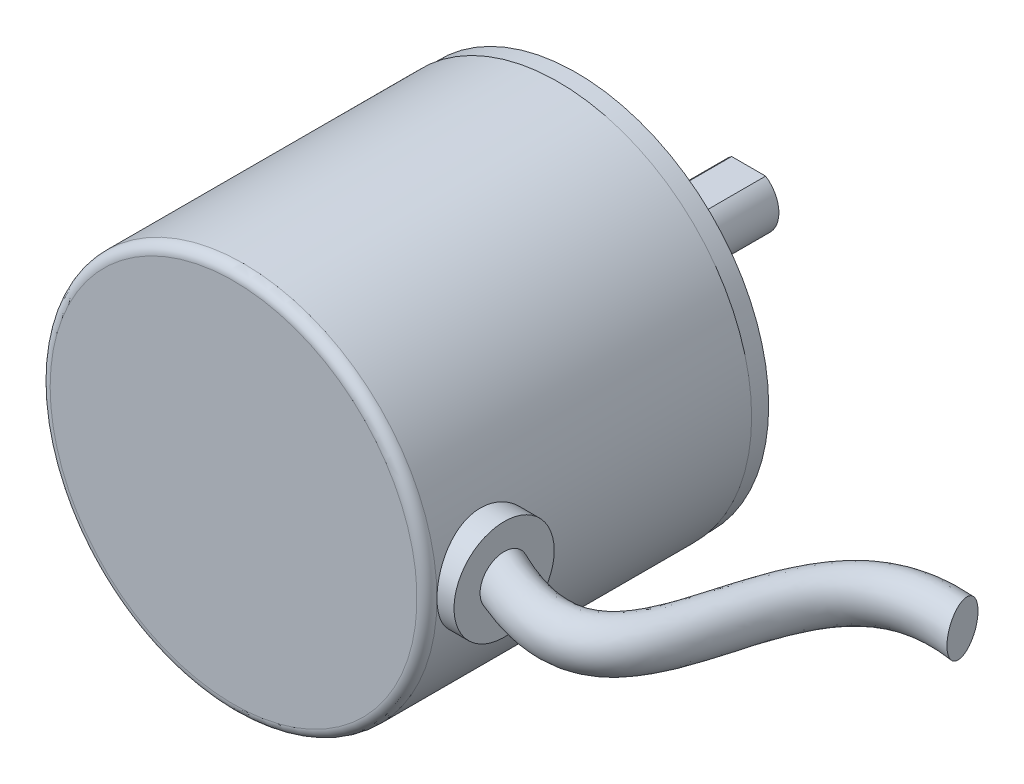
ISO-10303-21;
HEADER;
FILE_DESCRIPTION(('STEP AP214'),'2;1');
FILE_NAME('part.step','',(''),(''),'','','');
FILE_SCHEMA(('AUTOMOTIVE_DESIGN { 1 0 10303 214 1 1 1 1 }'));
ENDSEC;
DATA;
#1=APPLICATION_CONTEXT('core data for automotive mechanical design processes');
#2=APPLICATION_PROTOCOL_DEFINITION('international standard','automotive_design',2000,#1);
#3=PRODUCT_CONTEXT('',#1,'mechanical');
#4=PRODUCT('Part','Part','',(#3));
#5=PRODUCT_RELATED_PRODUCT_CATEGORY('part','',(#4));
#6=PRODUCT_DEFINITION_FORMATION('','',#4);
#7=PRODUCT_DEFINITION_CONTEXT('part definition',#1,'design');
#8=PRODUCT_DEFINITION('design','',#6,#7);
#9=PRODUCT_DEFINITION_SHAPE('','',#8);
#10=(LENGTH_UNIT() NAMED_UNIT(*) SI_UNIT(.MILLI.,.METRE.));
#11=(NAMED_UNIT(*) PLANE_ANGLE_UNIT() SI_UNIT($,.RADIAN.));
#12=(NAMED_UNIT(*) SI_UNIT($,.STERADIAN.) SOLID_ANGLE_UNIT());
#13=UNCERTAINTY_MEASURE_WITH_UNIT(LENGTH_MEASURE(1.E-05),#10,'distance_accuracy_value','');
#14=(GEOMETRIC_REPRESENTATION_CONTEXT(3) GLOBAL_UNCERTAINTY_ASSIGNED_CONTEXT((#13)) GLOBAL_UNIT_ASSIGNED_CONTEXT((#10,
#11,#12)) REPRESENTATION_CONTEXT('',''));
#15=CARTESIAN_POINT('',(0.,0.,0.));
#16=DIRECTION('',(0.,0.,1.));
#17=DIRECTION('',(1.,0.,0.));
#18=AXIS2_PLACEMENT_3D('',#15,#16,#17);
#19=CARTESIAN_POINT('',(0.,0.,0.));
#20=DIRECTION('',(0.,0.,1.));
#21=DIRECTION('',(1.,0.,0.));
#22=AXIS2_PLACEMENT_3D('',#19,#20,#21);
#23=CYLINDRICAL_SURFACE('',#22,19.3);
#24=CARTESIAN_POINT('',(0.,0.,-32.4));
#25=DIRECTION('',(0.,0.,1.));
#26=DIRECTION('',(1.,0.,0.));
#27=AXIS2_PLACEMENT_3D('',#24,#25,#26);
#28=CIRCLE('',#27,19.3);
#29=CARTESIAN_POINT('',(19.3,0.,-32.4));
#30=VERTEX_POINT('',#29);
#31=EDGE_CURVE('E119',#30,#30,#28,.T.);
#32=ORIENTED_EDGE('',*,*,#31,.T.);
#33=EDGE_LOOP('',(#32));
#34=FACE_BOUND('',#33,.T.);
#35=CARTESIAN_POINT('',(19.3,0.,-11.));
#36=CARTESIAN_POINT('',(19.2999955823132,0.275922296854778,-10.9999928770508));
#37=CARTESIAN_POINT('',(19.2940243522415,0.551922372861501,-10.9770833661282));
#38=CARTESIAN_POINT('',(19.2707832217401,1.09599052706957,-10.886201236279));
#39=CARTESIAN_POINT('',(19.2535074372038,1.36405439842268,-10.8182051492006));
#40=CARTESIAN_POINT('',(19.2095668815945,1.88431656958455,-10.6394946857354));
#41=CARTESIAN_POINT('',(19.1829138368732,2.1365342230973,-10.5288336457832));
#42=CARTESIAN_POINT('',(19.1230455895967,2.61882826887126,-10.2681276234945));
#43=CARTESIAN_POINT('',(19.0898300486462,2.84890351844845,-10.1180806100878));
#44=CARTESIAN_POINT('',(19.0196154495822,3.28544118051561,-9.77937747318028));
#45=CARTESIAN_POINT('',(18.9825546076903,3.49134729127922,-9.5900171431324));
#46=CARTESIAN_POINT('',(18.9092294286999,3.86886347852799,-9.17956906483793));
#47=CARTESIAN_POINT('',(18.8729651886307,4.04046939750563,-8.95847747603593));
#48=CARTESIAN_POINT('',(18.8047114585131,4.34718172860453,-8.48645852332762));
#49=CARTESIAN_POINT('',(18.7728001472016,4.48165636257465,-8.23510829957842));
#50=CARTESIAN_POINT('',(18.7177704081012,4.70622258399684,-7.71240743511189));
#51=CARTESIAN_POINT('',(18.6946504598122,4.79632184713577,-7.44106026264381));
#52=CARTESIAN_POINT('',(18.6604577314213,4.92766356036293,-6.89220895257353));
#53=CARTESIAN_POINT('',(18.6491376084621,4.96991077872982,-6.6149610354263));
#54=CARTESIAN_POINT('',(18.6390866109142,5.00748039103332,-6.05709956854782));
#55=CARTESIAN_POINT('',(18.640353526134,5.00281102317686,-5.77648661833454));
#56=CARTESIAN_POINT('',(18.6551116320814,4.94747953237369,-5.22763695769754));
#57=CARTESIAN_POINT('',(18.668281957902,4.89802456858564,-4.95926856071223));
#58=CARTESIAN_POINT('',(18.7048502811364,4.75645556426157,-4.43477415516337));
#59=CARTESIAN_POINT('',(18.7282490549199,4.66433828549686,-4.17864907754173));
#60=CARTESIAN_POINT('',(18.782925670159,4.4390550781482,-3.68272337186734));
#61=CARTESIAN_POINT('',(18.8142854052177,4.30545906400802,-3.44312752722263));
#62=CARTESIAN_POINT('',(18.8813054514343,4.00131106442746,-2.98932633069684));
#63=CARTESIAN_POINT('',(18.9169665653326,3.83075217608312,-2.77512573301329));
#64=CARTESIAN_POINT('',(18.9899140179257,3.45131027480728,-2.37128865501125));
#65=CARTESIAN_POINT('',(19.0272166358165,3.24141121656524,-2.18260850646035));
#66=CARTESIAN_POINT('',(19.0982594663905,2.7924989573545,-1.84293677781641));
#67=CARTESIAN_POINT('',(19.1319995538198,2.55348473336963,-1.69194652259743));
#68=CARTESIAN_POINT('',(19.1923044100216,2.05169995380134,-1.43155219368105));
#69=CARTESIAN_POINT('',(19.2188406202885,1.78884020273117,-1.32231295665176));
#70=CARTESIAN_POINT('',(19.261540870389,1.2476446713342,-1.14984575448703));
#71=CARTESIAN_POINT('',(19.2777070453288,0.969312089570021,-1.08660831759461));
#72=CARTESIAN_POINT('',(19.2975260496811,0.413240156975407,-1.00942230946256));
#73=CARTESIAN_POINT('',(19.3015091358126,0.135692917961652,-0.994172559703715));
#74=CARTESIAN_POINT('',(19.2974585703999,-0.417990665941433,-1.00981283524772));
#75=CARTESIAN_POINT('',(19.2894260861606,-0.694127145270174,-1.04069837853592));
#76=CARTESIAN_POINT('',(19.2624594750327,-1.23256340285446,-1.14666270598067));
#77=CARTESIAN_POINT('',(19.2437026678951,-1.49501425095196,-1.22102310195635));
#78=CARTESIAN_POINT('',(19.1974084064744,-2.00369685340097,-1.41099842811989));
#79=CARTESIAN_POINT('',(19.1698700292998,-2.24992689975833,-1.52661769452475));
#80=CARTESIAN_POINT('',(19.1082854087713,-2.72429044183067,-1.79829222998792));
#81=CARTESIAN_POINT('',(19.074126819279,-2.95199803647117,-1.95506506037911));
#82=CARTESIAN_POINT('',(19.0032537620583,-3.37833276890095,-2.30368750108891));
#83=CARTESIAN_POINT('',(18.9665388197629,-3.57695448577043,-2.49554363516018));
#84=CARTESIAN_POINT('',(18.8934880094063,-3.94490673451397,-2.91494530171224));
#85=CARTESIAN_POINT('',(18.8571879703588,-4.11332155969483,-3.14330187753011));
#86=CARTESIAN_POINT('',(18.7901539794982,-4.40945053300601,-3.62579419893768));
#87=CARTESIAN_POINT('',(18.7594197868037,-4.53716644270592,-3.87992882814904));
#88=CARTESIAN_POINT('',(18.7073449197866,-4.74731210499394,-4.40544316911878));
#89=CARTESIAN_POINT('',(18.6859491627699,-4.83000814294148,-4.67671064817692));
#90=CARTESIAN_POINT('',(18.6549412202573,-4.94843270252857,-5.22994402647412));
#91=CARTESIAN_POINT('',(18.6453262275589,-4.98417241339492,-5.51190736051442));
#92=CARTESIAN_POINT('',(18.6391935297198,-5.0070531294027,-6.06918033564821));
#93=CARTESIAN_POINT('',(18.6422802179428,-4.99566201023499,-6.34442628469769));
#94=CARTESIAN_POINT('',(18.6602822200317,-4.92798830414783,-6.88892866742926));
#95=CARTESIAN_POINT('',(18.6751972612514,-4.87170675196201,-7.15818523902068));
#96=CARTESIAN_POINT('',(18.7149467892529,-4.71667836613896,-7.68133479669966));
#97=CARTESIAN_POINT('',(18.7397124002066,-4.61822603332118,-7.93532065168203));
#98=CARTESIAN_POINT('',(18.7963778546488,-4.38188110097908,-8.4233570812115));
#99=CARTESIAN_POINT('',(18.8282787583192,-4.2439826395876,-8.65740468613371));
#100=CARTESIAN_POINT('',(18.8967317939109,-3.92814037420903,-9.10596778502445));
#101=CARTESIAN_POINT('',(18.9333888280616,-3.74918704166771,-9.31975654595521));
#102=CARTESIAN_POINT('',(19.0066196342379,-3.35825679179517,-9.71474714380576));
#103=CARTESIAN_POINT('',(19.0431933841368,-3.14627194855382,-9.89594113707157));
#104=CARTESIAN_POINT('',(19.1130039268547,-2.69021883218415,-10.2241207836628));
#105=CARTESIAN_POINT('',(19.1461600893385,-2.44559732438478,-10.3703561724299));
#106=CARTESIAN_POINT('',(19.2045327502046,-1.93439800228067,-10.6193958302361));
#107=CARTESIAN_POINT('',(19.2297546183081,-1.66783519208002,-10.7222294885933));
#108=CARTESIAN_POINT('',(19.2659375371114,-1.16834788877053,-10.867270957863));
#109=CARTESIAN_POINT('',(19.2786203773884,-0.937684470660252,-10.9169325114061));
#110=CARTESIAN_POINT('',(19.295653132073,-0.471365997029135,-10.9832986364701));
#111=CARTESIAN_POINT('',(19.3000037738851,-0.23571137905834,-11.0000060849022));
#112=CARTESIAN_POINT('',(19.3,0.,-11.));
#113=B_SPLINE_CURVE_WITH_KNOTS('',3,(#35,#36,#37,#38,#39,#40,#41,#42,#43,#44,#45,#46,#47,#48,
#49,#50,#51,#52,#53,#54,#55,#56,#57,#58,#59,#60,#61,#62,#63,#64,#65,#66,#67,#68,#69,#70,#71,#72,
#73,#74,#75,#76,#77,#78,#79,#80,#81,#82,#83,#84,#85,#86,#87,#88,#89,#90,#91,#92,#93,#94,#95,#96,
#97,#98,#99,#100,#101,#102,#103,#104,#105,#106,#107,#108,#109,#110,#111,#112),.UNSPECIFIED.,.T.,
.F.,(4,2,2,2,2,2,2,2,2,2,2,2,2,2,2,2,2,2,2,2,2,2,2,2,2,2,2,2,2,2,2,2,2,2,2,2,2,2,4),(0.,
0.826902765048128,1.65423628201614,2.48053886655304,3.3068840705377,4.14955475892465,
4.99232752510895,5.84866199633602,6.70484829379974,7.54270279895649,8.38041018560577,
9.19618877567788,10.0120292965359,10.8366287824067,11.6613823970852,12.5114631951909,
13.361573871106,14.2150070156434,15.0682643887744,15.8981771470126,16.728009284993,
17.5445018560062,18.3610802638869,19.1929702787829,20.0250151415136,20.8791093642488,
21.7331666142338,22.582115795559,23.4308626440062,24.2533777202322,25.0758738378656,
25.892717352371,26.7096823165105,27.5494306294879,28.3893807512248,29.2460005251929,
30.1020393080347,30.808496927949,31.5148928710041),.UNSPECIFIED.);
#114=CARTESIAN_POINT('',(19.3,0.,-1.));
#115=VERTEX_POINT('',#114);
#116=EDGE_CURVE('E126',#115,#115,#113,.T.);
#117=ORIENTED_EDGE('',*,*,#116,.F.);
#118=CARTESIAN_POINT('',(0.,0.,-1.));
#119=DIRECTION('',(0.,0.,-1.));
#120=DIRECTION('',(-1.,0.,0.));
#121=AXIS2_PLACEMENT_3D('',#118,#119,#120);
#122=CIRCLE('',#121,19.3);
#123=EDGE_CURVE('E11',#115,#115,#122,.T.);
#124=ORIENTED_EDGE('',*,*,#123,.T.);
#125=EDGE_LOOP('',(#117,#124));
#126=FACE_BOUND('',#125,.T.);
#127=ADVANCED_FACE('F43',(#34,#126),#23,.T.);
#128=CARTESIAN_POINT('',(0.,0.,0.));
#129=DIRECTION('',(0.,0.,1.));
#130=DIRECTION('',(1.,0.,0.));
#131=AXIS2_PLACEMENT_3D('',#128,#129,#130);
#132=CYLINDRICAL_SURFACE('',#131,3.02);
#133=CARTESIAN_POINT('',(0.,0.,-37.9));
#134=DIRECTION('',(0.,0.,1.));
#135=DIRECTION('',(1.,0.,0.));
#136=AXIS2_PLACEMENT_3D('',#133,#134,#135);
#137=CIRCLE('',#136,3.02);
#138=CARTESIAN_POINT('',(3.02,0.,-37.9));
#139=VERTEX_POINT('',#138);
#140=EDGE_CURVE('E98',#139,#139,#137,.T.);
#141=ORIENTED_EDGE('',*,*,#140,.F.);
#142=EDGE_LOOP('',(#141));
#143=FACE_BOUND('',#142,.T.);
#144=DIRECTION('',(0.,0.,1.));
#145=VECTOR('',#144,1.);
#146=CARTESIAN_POINT('',(-1.69422548676379,2.5,0.));
#147=LINE('',#146,#145);
#148=CARTESIAN_POINT('',(-1.69422548676379,2.5,-51.4));
#149=VERTEX_POINT('',#148);
#150=CARTESIAN_POINT('',(-1.69422548676379,2.5,-41.4));
#151=VERTEX_POINT('',#150);
#152=EDGE_CURVE('E93',#149,#151,#147,.T.);
#153=ORIENTED_EDGE('',*,*,#152,.F.);
#154=CARTESIAN_POINT('',(0.,0.,-51.4));
#155=DIRECTION('',(0.,0.,1.));
#156=DIRECTION('',(1.,0.,0.));
#157=AXIS2_PLACEMENT_3D('',#154,#155,#156);
#158=CIRCLE('',#157,3.02);
#159=CARTESIAN_POINT('',(1.69422548676379,2.5,-51.4));
#160=VERTEX_POINT('',#159);
#161=EDGE_CURVE('E95',#149,#160,#158,.T.);
#162=ORIENTED_EDGE('',*,*,#161,.T.);
#163=DIRECTION('',(0.,0.,1.));
#164=VECTOR('',#163,1.);
#165=CARTESIAN_POINT('',(1.69422548676379,2.5,0.));
#166=LINE('',#165,#164);
#167=CARTESIAN_POINT('',(1.69422548676379,2.5,-41.4));
#168=VERTEX_POINT('',#167);
#169=EDGE_CURVE('E61',#168,#160,#166,.F.);
#170=ORIENTED_EDGE('',*,*,#169,.F.);
#171=CARTESIAN_POINT('',(0.,0.,-41.4));
#172=DIRECTION('',(0.,0.,-1.));
#173=DIRECTION('',(-1.,0.,0.));
#174=AXIS2_PLACEMENT_3D('',#171,#172,#173);
#175=CIRCLE('',#174,3.02);
#176=EDGE_CURVE('E124',#151,#168,#175,.T.);
#177=ORIENTED_EDGE('',*,*,#176,.F.);
#178=EDGE_LOOP('',(#153,#162,#170,#177));
#179=FACE_BOUND('',#178,.T.);
#180=ADVANCED_FACE('F155',(#143,#179),#132,.T.);
#181=CARTESIAN_POINT('',(0.,3.02,-51.4));
#182=DIRECTION('',(0.,0.,1.));
#183=DIRECTION('',(1.,0.,0.));
#184=AXIS2_PLACEMENT_3D('',#181,#182,#183);
#185=PLANE('',#184);
#186=DIRECTION('',(-1.,0.,0.));
#187=VECTOR('',#186,1.);
#188=CARTESIAN_POINT('',(0.,2.5,-51.4));
#189=LINE('',#188,#187);
#190=EDGE_CURVE('E122',#160,#149,#189,.T.);
#191=ORIENTED_EDGE('',*,*,#190,.F.);
#192=ORIENTED_EDGE('',*,*,#161,.F.);
#193=EDGE_LOOP('',(#191,#192));
#194=FACE_BOUND('',#193,.T.);
#195=ADVANCED_FACE('F151',(#194),#185,.F.);
#196=CARTESIAN_POINT('',(0.,0.,0.));
#197=DIRECTION('',(0.,0.,-1.));
#198=DIRECTION('',(-1.,0.,0.));
#199=AXIS2_PLACEMENT_3D('',#196,#197,#198);
#200=PLANE('',#199);
#201=CARTESIAN_POINT('',(0.,0.,0.));
#202=DIRECTION('',(0.,0.,-1.));
#203=DIRECTION('',(-1.,0.,0.));
#204=AXIS2_PLACEMENT_3D('',#201,#202,#203);
#205=CIRCLE('',#204,18.3);
#206=CARTESIAN_POINT('',(-18.3,0.,0.));
#207=VERTEX_POINT('',#206);
#208=EDGE_CURVE('E51',#207,#207,#205,.F.);
#209=ORIENTED_EDGE('',*,*,#208,.T.);
#210=EDGE_LOOP('',(#209));
#211=FACE_BOUND('',#210,.T.);
#212=ADVANCED_FACE('F154',(#211),#200,.F.);
#213=CARTESIAN_POINT('',(0.,19.3,-32.4));
#214=DIRECTION('',(0.,0.,1.));
#215=DIRECTION('',(1.,0.,0.));
#216=AXIS2_PLACEMENT_3D('',#213,#214,#215);
#217=PLANE('',#216);
#218=ORIENTED_EDGE('',*,*,#31,.F.);
#219=EDGE_LOOP('',(#218));
#220=FACE_BOUND('',#219,.T.);
#221=CARTESIAN_POINT('',(0.,0.,-32.4));
#222=DIRECTION('',(0.,0.,1.));
#223=DIRECTION('',(1.,0.,0.));
#224=AXIS2_PLACEMENT_3D('',#221,#222,#223);
#225=CIRCLE('',#224,19.2);
#226=CARTESIAN_POINT('',(19.2,0.,-32.4));
#227=VERTEX_POINT('',#226);
#228=EDGE_CURVE('E116',#227,#227,#225,.T.);
#229=ORIENTED_EDGE('',*,*,#228,.T.);
#230=EDGE_LOOP('',(#229));
#231=FACE_BOUND('',#230,.T.);
#232=ADVANCED_FACE('F181',(#220,#231),#217,.F.);
#233=CARTESIAN_POINT('',(0.,0.,0.));
#234=DIRECTION('',(0.,0.,1.));
#235=DIRECTION('',(1.,0.,0.));
#236=AXIS2_PLACEMENT_3D('',#233,#234,#235);
#237=CYLINDRICAL_SURFACE('',#236,19.2);
#238=ORIENTED_EDGE('',*,*,#228,.F.);
#239=EDGE_LOOP('',(#238));
#240=FACE_BOUND('',#239,.T.);
#241=CARTESIAN_POINT('',(0.,0.,-34.2));
#242=DIRECTION('',(0.,0.,1.));
#243=DIRECTION('',(1.,0.,0.));
#244=AXIS2_PLACEMENT_3D('',#241,#242,#243);
#245=CIRCLE('',#244,19.2);
#246=CARTESIAN_POINT('',(19.2,0.,-34.2));
#247=VERTEX_POINT('',#246);
#248=EDGE_CURVE('E113',#247,#247,#245,.T.);
#249=ORIENTED_EDGE('',*,*,#248,.T.);
#250=EDGE_LOOP('',(#249));
#251=FACE_BOUND('',#250,.T.);
#252=ADVANCED_FACE('F178',(#240,#251),#237,.T.);
#253=CARTESIAN_POINT('',(0.,19.2,-34.2));
#254=DIRECTION('',(0.,0.,1.));
#255=DIRECTION('',(1.,0.,0.));
#256=AXIS2_PLACEMENT_3D('',#253,#254,#255);
#257=PLANE('',#256);
#258=CARTESIAN_POINT('',(0.,14.1,-34.2));
#259=DIRECTION('',(0.,0.,-1.));
#260=DIRECTION('',(-1.,0.,0.));
#261=AXIS2_PLACEMENT_3D('',#258,#259,#260);
#262=CIRCLE('',#261,1.25);
#263=CARTESIAN_POINT('',(-1.25,14.1,-34.2));
#264=VERTEX_POINT('',#263);
#265=EDGE_CURVE('E85',#264,#264,#262,.T.);
#266=ORIENTED_EDGE('',*,*,#265,.F.);
#267=EDGE_LOOP('',(#266));
#268=FACE_BOUND('',#267,.T.);
#269=CARTESIAN_POINT('',(-12.2109581933606,-7.05,-34.2));
#270=DIRECTION('',(0.,0.,-1.));
#271=DIRECTION('',(-1.,0.,0.));
#272=AXIS2_PLACEMENT_3D('',#269,#270,#271);
#273=CIRCLE('',#272,1.25);
#274=CARTESIAN_POINT('',(-13.4609581933606,-7.05,-34.2));
#275=VERTEX_POINT('',#274);
#276=EDGE_CURVE('E363',#275,#275,#273,.T.);
#277=ORIENTED_EDGE('',*,*,#276,.F.);
#278=EDGE_LOOP('',(#277));
#279=FACE_BOUND('',#278,.T.);
#280=CARTESIAN_POINT('',(12.2109581933606,-7.05000000000001,-34.2));
#281=DIRECTION('',(0.,0.,-1.));
#282=DIRECTION('',(-1.,0.,0.));
#283=AXIS2_PLACEMENT_3D('',#280,#281,#282);
#284=CIRCLE('',#283,1.25);
#285=CARTESIAN_POINT('',(10.9609581933606,-7.05000000000001,-34.2));
#286=VERTEX_POINT('',#285);
#287=EDGE_CURVE('E370',#286,#286,#284,.T.);
#288=ORIENTED_EDGE('',*,*,#287,.F.);
#289=EDGE_LOOP('',(#288));
#290=FACE_BOUND('',#289,.T.);
#291=ORIENTED_EDGE('',*,*,#248,.F.);
#292=EDGE_LOOP('',(#291));
#293=FACE_BOUND('',#292,.T.);
#294=CARTESIAN_POINT('',(0.,0.,-34.2));
#295=DIRECTION('',(0.,0.,1.));
#296=DIRECTION('',(1.,0.,0.));
#297=AXIS2_PLACEMENT_3D('',#294,#295,#296);
#298=CIRCLE('',#297,10.01);
#299=CARTESIAN_POINT('',(10.01,0.,-34.2));
#300=VERTEX_POINT('',#299);
#301=EDGE_CURVE('E110',#300,#300,#298,.T.);
#302=ORIENTED_EDGE('',*,*,#301,.T.);
#303=EDGE_LOOP('',(#302));
#304=FACE_BOUND('',#303,.T.);
#305=ADVANCED_FACE('F174',(#268,#279,#290,#293,#304),#257,.F.);
#306=CARTESIAN_POINT('',(0.,0.,0.));
#307=DIRECTION('',(0.,0.,1.));
#308=DIRECTION('',(1.,0.,0.));
#309=AXIS2_PLACEMENT_3D('',#306,#307,#308);
#310=CYLINDRICAL_SURFACE('',#309,10.01);
#311=ORIENTED_EDGE('',*,*,#301,.F.);
#312=EDGE_LOOP('',(#311));
#313=FACE_BOUND('',#312,.T.);
#314=CARTESIAN_POINT('',(0.,0.,-39.4));
#315=DIRECTION('',(0.,0.,1.));
#316=DIRECTION('',(1.,0.,0.));
#317=AXIS2_PLACEMENT_3D('',#314,#315,#316);
#318=CIRCLE('',#317,10.01);
#319=CARTESIAN_POINT('',(10.01,0.,-39.4));
#320=VERTEX_POINT('',#319);
#321=EDGE_CURVE('E107',#320,#320,#318,.T.);
#322=ORIENTED_EDGE('',*,*,#321,.T.);
#323=EDGE_LOOP('',(#322));
#324=FACE_BOUND('',#323,.T.);
#325=ADVANCED_FACE('F170',(#313,#324),#310,.T.);
#326=CARTESIAN_POINT('',(0.,10.01,-39.4));
#327=DIRECTION('',(0.,0.,1.));
#328=DIRECTION('',(1.,0.,0.));
#329=AXIS2_PLACEMENT_3D('',#326,#327,#328);
#330=PLANE('',#329);
#331=ORIENTED_EDGE('',*,*,#321,.F.);
#332=EDGE_LOOP('',(#331));
#333=FACE_BOUND('',#332,.T.);
#334=CARTESIAN_POINT('',(0.,0.,-39.4));
#335=DIRECTION('',(0.,0.,1.));
#336=DIRECTION('',(1.,0.,0.));
#337=AXIS2_PLACEMENT_3D('',#334,#335,#336);
#338=CIRCLE('',#337,7.5);
#339=CARTESIAN_POINT('',(7.5,0.,-39.4));
#340=VERTEX_POINT('',#339);
#341=EDGE_CURVE('E104',#340,#340,#338,.T.);
#342=ORIENTED_EDGE('',*,*,#341,.T.);
#343=EDGE_LOOP('',(#342));
#344=FACE_BOUND('',#343,.T.);
#345=ADVANCED_FACE('F166',(#333,#344),#330,.F.);
#346=CARTESIAN_POINT('',(0.,0.,0.));
#347=DIRECTION('',(0.,0.,1.));
#348=DIRECTION('',(1.,0.,0.));
#349=AXIS2_PLACEMENT_3D('',#346,#347,#348);
#350=CYLINDRICAL_SURFACE('',#349,7.5);
#351=ORIENTED_EDGE('',*,*,#341,.F.);
#352=EDGE_LOOP('',(#351));
#353=FACE_BOUND('',#352,.T.);
#354=CARTESIAN_POINT('',(0.,0.,-37.9));
#355=DIRECTION('',(0.,0.,1.));
#356=DIRECTION('',(1.,0.,0.));
#357=AXIS2_PLACEMENT_3D('',#354,#355,#356);
#358=CIRCLE('',#357,7.5);
#359=CARTESIAN_POINT('',(7.5,0.,-37.9));
#360=VERTEX_POINT('',#359);
#361=EDGE_CURVE('E101',#360,#360,#358,.T.);
#362=ORIENTED_EDGE('',*,*,#361,.T.);
#363=EDGE_LOOP('',(#362));
#364=FACE_BOUND('',#363,.T.);
#365=ADVANCED_FACE('F162',(#353,#364),#350,.F.);
#366=CARTESIAN_POINT('',(0.,7.5,-37.9));
#367=DIRECTION('',(0.,0.,1.));
#368=DIRECTION('',(1.,0.,0.));
#369=AXIS2_PLACEMENT_3D('',#366,#367,#368);
#370=PLANE('',#369);
#371=ORIENTED_EDGE('',*,*,#361,.F.);
#372=EDGE_LOOP('',(#371));
#373=FACE_BOUND('',#372,.T.);
#374=ORIENTED_EDGE('',*,*,#140,.T.);
#375=EDGE_LOOP('',(#374));
#376=FACE_BOUND('',#375,.T.);
#377=ADVANCED_FACE('F149',(#373,#376),#370,.F.);
#378=CARTESIAN_POINT('',(-7.5,12.5,-41.4));
#379=DIRECTION('',(0.,0.,-1.));
#380=DIRECTION('',(-1.,0.,0.));
#381=AXIS2_PLACEMENT_3D('',#378,#379,#380);
#382=PLANE('',#381);
#383=ORIENTED_EDGE('',*,*,#176,.T.);
#384=DIRECTION('',(1.,0.,0.));
#385=VECTOR('',#384,1.);
#386=CARTESIAN_POINT('',(-7.5,2.5,-41.4));
#387=LINE('',#386,#385);
#388=EDGE_CURVE('E82',#151,#168,#387,.T.);
#389=ORIENTED_EDGE('',*,*,#388,.F.);
#390=EDGE_LOOP('',(#383,#389));
#391=FACE_BOUND('',#390,.T.);
#392=ADVANCED_FACE('F146',(#391),#382,.T.);
#393=CARTESIAN_POINT('',(0.,2.5,0.));
#394=DIRECTION('',(0.,1.,0.));
#395=DIRECTION('',(0.,0.,1.));
#396=AXIS2_PLACEMENT_3D('',#393,#394,#395);
#397=PLANE('',#396);
#398=ORIENTED_EDGE('',*,*,#152,.T.);
#399=ORIENTED_EDGE('',*,*,#388,.T.);
#400=ORIENTED_EDGE('',*,*,#169,.T.);
#401=ORIENTED_EDGE('',*,*,#190,.T.);
#402=EDGE_LOOP('',(#398,#399,#400,#401));
#403=FACE_BOUND('',#402,.T.);
#404=ADVANCED_FACE('F141',(#403),#397,.T.);
#405=CARTESIAN_POINT('',(21.,0.,-6.));
#406=DIRECTION('',(-1.,0.,0.));
#407=DIRECTION('',(0.,0.,1.));
#408=AXIS2_PLACEMENT_3D('',#405,#406,#407);
#409=CYLINDRICAL_SURFACE('',#408,5.);
#410=CARTESIAN_POINT('',(21.,0.,-6.));
#411=DIRECTION('',(1.,0.,0.));
#412=DIRECTION('',(0.,0.,-1.));
#413=AXIS2_PLACEMENT_3D('',#410,#411,#412);
#414=CIRCLE('',#413,5.);
#415=CARTESIAN_POINT('',(21.,0.,-11.));
#416=VERTEX_POINT('',#415);
#417=EDGE_CURVE('E78',#416,#416,#414,.T.);
#418=ORIENTED_EDGE('',*,*,#417,.F.);
#419=EDGE_LOOP('',(#418));
#420=FACE_BOUND('',#419,.T.);
#421=ORIENTED_EDGE('',*,*,#116,.T.);
#422=EDGE_LOOP('',(#421));
#423=FACE_BOUND('',#422,.T.);
#424=ADVANCED_FACE('F135',(#420,#423),#409,.T.);
#425=CARTESIAN_POINT('',(21.,0.,-6.));
#426=DIRECTION('',(1.,0.,0.));
#427=DIRECTION('',(0.,0.,-1.));
#428=AXIS2_PLACEMENT_3D('',#425,#426,#427);
#429=PLANE('',#428);
#430=CARTESIAN_POINT('',(21.,0.,-6.));
#431=DIRECTION('',(1.,0.,0.));
#432=DIRECTION('',(0.,0.,-1.));
#433=AXIS2_PLACEMENT_3D('',#430,#431,#432);
#434=CIRCLE('',#433,2.4);
#435=CARTESIAN_POINT('',(21.,0.,-8.4));
#436=VERTEX_POINT('',#435);
#437=EDGE_CURVE('E88',#436,#436,#434,.T.);
#438=ORIENTED_EDGE('',*,*,#437,.F.);
#439=EDGE_LOOP('',(#438));
#440=FACE_BOUND('',#439,.T.);
#441=ORIENTED_EDGE('',*,*,#417,.T.);
#442=EDGE_LOOP('',(#441));
#443=FACE_BOUND('',#442,.T.);
#444=ADVANCED_FACE('F140',(#440,#443),#429,.T.);
#445=CARTESIAN_POINT('',(48.1067347892045,0.,-24.6321246415799));
#446=DIRECTION('',(0.95184078306467,0.,-0.30659276523564));
#447=DIRECTION('',(-0.30659276523564,0.,-0.95184078306467));
#448=AXIS2_PLACEMENT_3D('',#445,#446,#447);
#449=PLANE('',#448);
#450=CARTESIAN_POINT('',(48.1067347892045,0.,-24.6321246415799));
#451=DIRECTION('',(0.95184078306467,0.,-0.30659276523564));
#452=DIRECTION('',(-0.30659276523564,0.,-0.95184078306467));
#453=AXIS2_PLACEMENT_3D('',#450,#451,#452);
#454=CIRCLE('',#453,2.4);
#455=CARTESIAN_POINT('',(47.370912152639,0.,-26.9165425209351));
#456=VERTEX_POINT('',#455);
#457=EDGE_CURVE('E75',#456,#456,#454,.T.);
#458=ORIENTED_EDGE('',*,*,#457,.T.);
#459=EDGE_LOOP('',(#458));
#460=FACE_BOUND('',#459,.T.);
#461=ADVANCED_FACE('F76',(#460),#449,.T.);
#462=CARTESIAN_POINT('',(21.,0.,-8.4));
#463=CARTESIAN_POINT('',(23.4061497538981,0.,-7.23076096868964));
#464=CARTESIAN_POINT('',(25.2019365047541,0.,-6.66914936012797));
#465=CARTESIAN_POINT('',(27.1234503761555,0.,-6.3143301159636));
#466=CARTESIAN_POINT('',(27.6373981055793,0.,-6.27059679383991));
#467=CARTESIAN_POINT('',(28.5274741173509,0.,-6.27799249415717));
#468=CARTESIAN_POINT('',(28.9104184725048,0.,-6.32937232729666));
#469=CARTESIAN_POINT('',(30.0326714214068,0.,-6.72406218191732));
#470=CARTESIAN_POINT('',(30.7443266632482,0.,-7.37428851667437));
#471=CARTESIAN_POINT('',(31.9540533489362,0.,-9.42876488449995));
#472=CARTESIAN_POINT('',(32.4459917518559,0.,-10.7867413184069));
#473=CARTESIAN_POINT('',(33.3626767859222,0.,-13.7700844788861));
#474=CARTESIAN_POINT('',(33.7917878667776,0.,-15.3959415381152));
#475=CARTESIAN_POINT('',(34.8739953767951,0.,-18.6546019219234));
#476=CARTESIAN_POINT('',(35.5222065531489,0.,-20.2979490538556));
#477=CARTESIAN_POINT('',(37.4772484669671,0.,-23.3554864740305));
#478=CARTESIAN_POINT('',(38.8238178261162,0.,-24.7749052152496));
#479=CARTESIAN_POINT('',(42.4766153353687,0.,-26.654995042772));
#480=CARTESIAN_POINT('',(44.7267985080285,0.,-27.08676434553));
#481=CARTESIAN_POINT('',(47.370912152639,0.,-26.9165425209351));
#482=CARTESIAN_POINT('',(21.,4.8,-8.4));
#483=CARTESIAN_POINT('',(23.4061497538981,4.8,-7.23076096868964));
#484=CARTESIAN_POINT('',(25.2019365047541,4.8,-6.66914936012797));
#485=CARTESIAN_POINT('',(27.1234503761555,4.8,-6.3143301159636));
#486=CARTESIAN_POINT('',(27.6373981055793,4.8,-6.27059679383991));
#487=CARTESIAN_POINT('',(28.5274741173509,4.8,-6.27799249415717));
#488=CARTESIAN_POINT('',(28.9104184725048,4.8,-6.32937232729666));
#489=CARTESIAN_POINT('',(30.0326714214068,4.8,-6.72406218191732));
#490=CARTESIAN_POINT('',(30.7443266632482,4.8,-7.37428851667437));
#491=CARTESIAN_POINT('',(31.9540533489362,4.8,-9.42876488449995));
#492=CARTESIAN_POINT('',(32.4459917518559,4.8,-10.7867413184069));
#493=CARTESIAN_POINT('',(33.3626767859222,4.8,-13.7700844788861));
#494=CARTESIAN_POINT('',(33.7917878667776,4.8,-15.3959415381152));
#495=CARTESIAN_POINT('',(34.8739953767951,4.8,-18.6546019219234));
#496=CARTESIAN_POINT('',(35.5222065531489,4.8,-20.2979490538556));
#497=CARTESIAN_POINT('',(37.4772484669671,4.8,-23.3554864740305));
#498=CARTESIAN_POINT('',(38.8238178261162,4.8,-24.7749052152496));
#499=CARTESIAN_POINT('',(42.4766153353687,4.8,-26.654995042772));
#500=CARTESIAN_POINT('',(44.7267985080285,4.8,-27.08676434553));
#501=CARTESIAN_POINT('',(47.370912152639,4.8,-26.9165425209351));
#502=CARTESIAN_POINT('',(21.,4.8,-3.6));
#503=CARTESIAN_POINT('',(23.7968534245657,4.8,-2.43076096763515));
#504=CARTESIAN_POINT('',(26.1608585713839,4.8,-1.88634824424708));
#505=CARTESIAN_POINT('',(29.2940143391469,4.8,-2.0111532026254));
#506=CARTESIAN_POINT('',(30.267453448005,4.8,-2.21638547242162));
#507=CARTESIAN_POINT('',(32.02044483964,4.8,-2.93838532910833));
#508=CARTESIAN_POINT('',(32.7931810350386,4.8,-3.45490212140323));
#509=CARTESIAN_POINT('',(34.7353600105968,4.8,-5.26858403454208));
#510=CARTESIAN_POINT('',(35.5298463654021,4.8,-6.76351478902703));
#511=CARTESIAN_POINT('',(36.7651751762082,4.8,-9.78562650983917));
#512=CARTESIAN_POINT('',(37.2121506446514,4.8,-11.3590811068591));
#513=CARTESIAN_POINT('',(38.1124639290351,4.8,-14.4653294180479));
#514=CARTESIAN_POINT('',(38.5614372719404,4.8,-15.9976328252867));
#515=CARTESIAN_POINT('',(39.6809674619894,4.8,-18.7224782791542));
#516=CARTESIAN_POINT('',(40.356409539133,4.8,-19.9044765434955));
#517=CARTESIAN_POINT('',(42.0006412657589,4.8,-21.6052703109256));
#518=CARTESIAN_POINT('',(42.9296922693407,4.8,-22.1188373876794));
#519=CARTESIAN_POINT('',(45.2865008962542,4.8,-22.6528150854102));
#520=CARTESIAN_POINT('',(46.7703034818158,4.8,-22.7021275066778));
#521=CARTESIAN_POINT('',(48.8425574257701,4.8,-22.3477067622247));
#522=CARTESIAN_POINT('',(21.,0.,-3.6));
#523=CARTESIAN_POINT('',(23.7968534245657,0.,-2.43076096763515));
#524=CARTESIAN_POINT('',(26.1608585713839,0.,-1.88634824424707));
#525=CARTESIAN_POINT('',(29.2940143391469,0.,-2.01115320262539));
#526=CARTESIAN_POINT('',(30.2674534480044,0.,-2.21638547242162));
#527=CARTESIAN_POINT('',(32.0204448396406,0.,-2.93838532910833));
#528=CARTESIAN_POINT('',(32.7931810350386,0.,-3.45490212140323));
#529=CARTESIAN_POINT('',(34.7353600105968,0.,-5.26858403454207));
#530=CARTESIAN_POINT('',(35.5298463654046,0.,-6.76351478902703));
#531=CARTESIAN_POINT('',(36.7651751762058,0.,-9.78562650983917));
#532=CARTESIAN_POINT('',(37.2121506446514,0.,-11.3590811068591));
#533=CARTESIAN_POINT('',(38.1124639290351,0.,-14.4653294180479));
#534=CARTESIAN_POINT('',(38.5614372719404,0.,-15.9976328252867));
#535=CARTESIAN_POINT('',(39.6809674619894,0.,-18.7224782791542));
#536=CARTESIAN_POINT('',(40.356409539133,0.,-19.9044765434955));
#537=CARTESIAN_POINT('',(42.0006412657589,0.,-21.6052703109256));
#538=CARTESIAN_POINT('',(42.9296922693379,0.,-22.1188373876794));
#539=CARTESIAN_POINT('',(45.286500896257,0.,-22.6528150854102));
#540=CARTESIAN_POINT('',(46.7703034818158,0.,-22.7021275066839));
#541=CARTESIAN_POINT('',(48.8425574257701,0.,-22.3477067622247));
#542=CARTESIAN_POINT('',(21.,-4.8,-3.6));
#543=CARTESIAN_POINT('',(23.7968534245657,-4.8,-2.43076096763515));
#544=CARTESIAN_POINT('',(26.1608585713839,-4.8,-1.88634824424707));
#545=CARTESIAN_POINT('',(29.2940143391469,-4.8,-2.01115320262539));
#546=CARTESIAN_POINT('',(30.2674534480038,-4.8,-2.21638547242162));
#547=CARTESIAN_POINT('',(32.0204448396412,-4.8,-2.93838532910833));
#548=CARTESIAN_POINT('',(32.7931810350386,-4.8,-3.45490212140323));
#549=CARTESIAN_POINT('',(34.7353600105968,-4.8,-5.26858403454207));
#550=CARTESIAN_POINT('',(35.529846365407,-4.8,-6.76351478902703));
#551=CARTESIAN_POINT('',(36.7651751762033,-4.8,-9.78562650983917));
#552=CARTESIAN_POINT('',(37.2121506446514,-4.8,-11.3590811068591));
#553=CARTESIAN_POINT('',(38.1124639290351,-4.8,-14.4653294180479));
#554=CARTESIAN_POINT('',(38.5614372719404,-4.8,-15.9976328252867));
#555=CARTESIAN_POINT('',(39.6809674619894,-4.8,-18.7224782791542));
#556=CARTESIAN_POINT('',(40.356409539133,-4.8,-19.9044765434955));
#557=CARTESIAN_POINT('',(42.0006412657589,-4.8,-21.6052703109256));
#558=CARTESIAN_POINT('',(42.9296922693351,-4.8,-22.1188373876794));
#559=CARTESIAN_POINT('',(45.2865008962598,-4.8,-22.6528150854102));
#560=CARTESIAN_POINT('',(46.7703034818158,-4.8,-22.7021275066901));
#561=CARTESIAN_POINT('',(48.8425574257701,-4.8,-22.3477067622247));
#562=CARTESIAN_POINT('',(21.,-4.8,-8.4));
#563=CARTESIAN_POINT('',(23.4061497538981,-4.8,-7.23076096868964));
#564=CARTESIAN_POINT('',(25.2019365047541,-4.8,-6.66914936012797));
#565=CARTESIAN_POINT('',(27.1234503761555,-4.8,-6.3143301159636));
#566=CARTESIAN_POINT('',(27.6373981055793,-4.8,-6.27059679383991));
#567=CARTESIAN_POINT('',(28.5274741173509,-4.8,-6.27799249415717));
#568=CARTESIAN_POINT('',(28.9104184725048,-4.8,-6.32937232729666));
#569=CARTESIAN_POINT('',(30.0326714214068,-4.8,-6.72406218191732));
#570=CARTESIAN_POINT('',(30.7443266632482,-4.8,-7.37428851667437));
#571=CARTESIAN_POINT('',(31.9540533489362,-4.8,-9.42876488449995));
#572=CARTESIAN_POINT('',(32.4459917518559,-4.8,-10.7867413184069));
#573=CARTESIAN_POINT('',(33.3626767859222,-4.8,-13.7700844788861));
#574=CARTESIAN_POINT('',(33.7917878667776,-4.8,-15.3959415381152));
#575=CARTESIAN_POINT('',(34.8739953767951,-4.8,-18.6546019219234));
#576=CARTESIAN_POINT('',(35.5222065531489,-4.8,-20.2979490538556));
#577=CARTESIAN_POINT('',(37.4772484669671,-4.8,-23.3554864740305));
#578=CARTESIAN_POINT('',(38.8238178261162,-4.8,-24.7749052152496));
#579=CARTESIAN_POINT('',(42.4766153353687,-4.8,-26.654995042772));
#580=CARTESIAN_POINT('',(44.7267985080285,-4.8,-27.08676434553));
#581=CARTESIAN_POINT('',(47.370912152639,-4.8,-26.9165425209351));
#582=CARTESIAN_POINT('',(21.,0.,-8.4));
#583=CARTESIAN_POINT('',(23.4061497538981,0.,-7.23076096868964));
#584=CARTESIAN_POINT('',(25.2019365047541,0.,-6.66914936012797));
#585=CARTESIAN_POINT('',(27.1234503761555,0.,-6.3143301159636));
#586=CARTESIAN_POINT('',(27.6373981055793,0.,-6.27059679383991));
#587=CARTESIAN_POINT('',(28.5274741173509,0.,-6.27799249415717));
#588=CARTESIAN_POINT('',(28.9104184725048,0.,-6.32937232729666));
#589=CARTESIAN_POINT('',(30.0326714214068,0.,-6.72406218191732));
#590=CARTESIAN_POINT('',(30.7443266632482,0.,-7.37428851667437));
#591=CARTESIAN_POINT('',(31.9540533489362,0.,-9.42876488449995));
#592=CARTESIAN_POINT('',(32.4459917518559,0.,-10.7867413184069));
#593=CARTESIAN_POINT('',(33.3626767859222,0.,-13.7700844788861));
#594=CARTESIAN_POINT('',(33.7917878667776,0.,-15.3959415381152));
#595=CARTESIAN_POINT('',(34.8739953767951,0.,-18.6546019219234));
#596=CARTESIAN_POINT('',(35.5222065531489,0.,-20.2979490538556));
#597=CARTESIAN_POINT('',(37.4772484669671,0.,-23.3554864740305));
#598=CARTESIAN_POINT('',(38.8238178261162,0.,-24.7749052152496));
#599=CARTESIAN_POINT('',(42.4766153353687,0.,-26.654995042772));
#600=CARTESIAN_POINT('',(44.7267985080285,0.,-27.08676434553));
#601=CARTESIAN_POINT('',(47.370912152639,0.,-26.9165425209351));
#602=(BOUNDED_SURFACE() B_SPLINE_SURFACE(3,3,((#462,#463,#464,#465,#466,#467,#468,#469,#470,
#471,#472,#473,#474,#475,#476,#477,#478,#479,#480,#481),(#482,#483,#484,#485,#486,#487,#488,
#489,#490,#491,#492,#493,#494,#495,#496,#497,#498,#499,#500,#501),(#502,#503,#504,#505,#506,
#507,#508,#509,#510,#511,#512,#513,#514,#515,#516,#517,#518,#519,#520,#521),(#522,#523,#524,
#525,#526,#527,#528,#529,#530,#531,#532,#533,#534,#535,#536,#537,#538,#539,#540,#541),(#542,
#543,#544,#545,#546,#547,#548,#549,#550,#551,#552,#553,#554,#555,#556,#557,#558,#559,#560,#561),
(#562,#563,#564,#565,#566,#567,#568,#569,#570,#571,#572,#573,#574,#575,#576,#577,#578,#579,#580,
#581),(#582,#583,#584,#585,#586,#587,#588,#589,#590,#591,#592,#593,#594,#595,#596,#597,#598,
#599,#600,#601)),.UNSPECIFIED.,.T.,.F.,.F.) B_SPLINE_SURFACE_WITH_KNOTS((4,3,4),(4,2,2,2,2,2,2,
2,2,4),(0.,0.5,1.),(0.,0.125,0.1875,0.25,0.375,0.5,0.625,0.75,0.875,1.),
.UNSPECIFIED.) GEOMETRIC_REPRESENTATION_ITEM() RATIONAL_B_SPLINE_SURFACE(((1.,1.,1.,1.,1.,1.,1.,
1.,1.,1.,1.,1.,1.,1.,1.,1.,1.,1.,1.,1.),(0.333333333333333,0.333333333333333,0.333333333333333,
0.333333333333333,0.333333333333333,0.333333333333333,0.333333333333333,0.333333333333333,
0.333333333333333,0.333333333333333,0.333333333333333,0.333333333333333,0.333333333333333,
0.333333333333333,0.333333333333333,0.333333333333333,0.333333333333333,0.333333333333333,
0.333333333333333,0.333333333333333),(0.333333333333333,0.333333333333333,0.333333333333333,
0.333333333333333,0.333333333333333,0.333333333333333,0.333333333333333,0.333333333333333,
0.333333333333333,0.333333333333333,0.333333333333333,0.333333333333333,0.333333333333333,
0.333333333333333,0.333333333333333,0.333333333333333,0.333333333333333,0.333333333333333,
0.333333333333333,0.333333333333333),(1.,1.,1.,1.,1.,1.,1.,1.,1.,1.,1.,1.,1.,1.,1.,1.,1.,1.,1.,
1.),(0.333333333333333,0.333333333333333,0.333333333333333,0.333333333333333,0.333333333333333,
0.333333333333333,0.333333333333333,0.333333333333333,0.333333333333333,0.333333333333333,
0.333333333333333,0.333333333333333,0.333333333333333,0.333333333333333,0.333333333333333,
0.333333333333333,0.333333333333333,0.333333333333333,0.333333333333333,0.333333333333333),
(0.333333333333333,0.333333333333333,0.333333333333333,0.333333333333333,0.333333333333333,
0.333333333333333,0.333333333333333,0.333333333333333,0.333333333333333,0.333333333333333,
0.333333333333333,0.333333333333333,0.333333333333333,0.333333333333333,0.333333333333333,
0.333333333333333,0.333333333333333,0.333333333333333,0.333333333333333,0.333333333333333),(1.,
1.,1.,1.,1.,1.,1.,1.,1.,1.,1.,1.,1.,1.,1.,1.,1.,1.,1.,1.))) REPRESENTATION_ITEM('') SURFACE());
#603=ORIENTED_EDGE('',*,*,#457,.F.);
#604=EDGE_LOOP('',(#603));
#605=FACE_BOUND('',#604,.T.);
#606=ORIENTED_EDGE('',*,*,#437,.T.);
#607=EDGE_LOOP('',(#606));
#608=FACE_BOUND('',#607,.T.);
#609=ADVANCED_FACE('F213',(#605,#608),#602,.T.);
#610=CARTESIAN_POINT('',(0.,0.,-1.));
#611=DIRECTION('',(0.,0.,-1.));
#612=DIRECTION('',(-1.,0.,0.));
#613=AXIS2_PLACEMENT_3D('',#610,#611,#612);
#614=TOROIDAL_SURFACE('',#613,18.3,1.);
#615=ORIENTED_EDGE('',*,*,#123,.F.);
#616=EDGE_LOOP('',(#615));
#617=FACE_BOUND('',#616,.T.);
#618=ORIENTED_EDGE('',*,*,#208,.F.);
#619=EDGE_LOOP('',(#618));
#620=FACE_BOUND('',#619,.T.);
#621=ADVANCED_FACE('F45',(#617,#620),#614,.T.);
#622=CARTESIAN_POINT('',(12.2109581933606,-7.05000000000001,-29.2));
#623=DIRECTION('',(0.,0.,-1.));
#624=DIRECTION('',(-1.,0.,0.));
#625=AXIS2_PLACEMENT_3D('',#622,#623,#624);
#626=CYLINDRICAL_SURFACE('',#625,1.25);
#627=CARTESIAN_POINT('',(12.2109581933606,-7.05000000000001,-29.2));
#628=DIRECTION('',(0.,0.,-1.));
#629=DIRECTION('',(-1.,0.,0.));
#630=AXIS2_PLACEMENT_3D('',#627,#628,#629);
#631=CIRCLE('',#630,1.25);
#632=CARTESIAN_POINT('',(10.9609581933606,-7.05000000000001,-29.2));
#633=VERTEX_POINT('',#632);
#634=EDGE_CURVE('E368',#633,#633,#631,.T.);
#635=ORIENTED_EDGE('',*,*,#634,.F.);
#636=EDGE_LOOP('',(#635));
#637=FACE_BOUND('',#636,.T.);
#638=ORIENTED_EDGE('',*,*,#287,.T.);
#639=EDGE_LOOP('',(#638));
#640=FACE_BOUND('',#639,.T.);
#641=ADVANCED_FACE('F224',(#637,#640),#626,.F.);
#642=CARTESIAN_POINT('',(12.2109581933606,-7.05000000000001,-29.2));
#643=DIRECTION('',(0.,0.,-1.));
#644=DIRECTION('',(-1.,0.,0.));
#645=AXIS2_PLACEMENT_3D('',#642,#643,#644);
#646=PLANE('',#645);
#647=ORIENTED_EDGE('',*,*,#634,.T.);
#648=EDGE_LOOP('',(#647));
#649=FACE_BOUND('',#648,.T.);
#650=ADVANCED_FACE('F306',(#649),#646,.T.);
#651=CARTESIAN_POINT('',(-12.2109581933606,-7.05,-29.2));
#652=DIRECTION('',(0.,0.,-1.));
#653=DIRECTION('',(-1.,0.,0.));
#654=AXIS2_PLACEMENT_3D('',#651,#652,#653);
#655=CYLINDRICAL_SURFACE('',#654,1.25);
#656=CARTESIAN_POINT('',(-12.2109581933606,-7.05,-29.2));
#657=DIRECTION('',(0.,0.,-1.));
#658=DIRECTION('',(-1.,0.,0.));
#659=AXIS2_PLACEMENT_3D('',#656,#657,#658);
#660=CIRCLE('',#659,1.25);
#661=CARTESIAN_POINT('',(-13.4609581933606,-7.05,-29.2));
#662=VERTEX_POINT('',#661);
#663=EDGE_CURVE('E360',#662,#662,#660,.T.);
#664=ORIENTED_EDGE('',*,*,#663,.F.);
#665=EDGE_LOOP('',(#664));
#666=FACE_BOUND('',#665,.T.);
#667=ORIENTED_EDGE('',*,*,#276,.T.);
#668=EDGE_LOOP('',(#667));
#669=FACE_BOUND('',#668,.T.);
#670=ADVANCED_FACE('F314',(#666,#669),#655,.F.);
#671=CARTESIAN_POINT('',(-12.2109581933606,-7.05,-29.2));
#672=DIRECTION('',(0.,0.,-1.));
#673=DIRECTION('',(-1.,0.,0.));
#674=AXIS2_PLACEMENT_3D('',#671,#672,#673);
#675=PLANE('',#674);
#676=ORIENTED_EDGE('',*,*,#663,.T.);
#677=EDGE_LOOP('',(#676));
#678=FACE_BOUND('',#677,.T.);
#679=ADVANCED_FACE('F322',(#678),#675,.T.);
#680=CARTESIAN_POINT('',(0.,14.1,-29.2));
#681=DIRECTION('',(0.,0.,-1.));
#682=DIRECTION('',(-1.,0.,0.));
#683=AXIS2_PLACEMENT_3D('',#680,#681,#682);
#684=CYLINDRICAL_SURFACE('',#683,1.25);
#685=CARTESIAN_POINT('',(0.,14.1,-29.2));
#686=DIRECTION('',(0.,0.,-1.));
#687=DIRECTION('',(-1.,0.,0.));
#688=AXIS2_PLACEMENT_3D('',#685,#686,#687);
#689=CIRCLE('',#688,1.25);
#690=CARTESIAN_POINT('',(-1.25,14.1,-29.2));
#691=VERTEX_POINT('',#690);
#692=EDGE_CURVE('E79',#691,#691,#689,.T.);
#693=ORIENTED_EDGE('',*,*,#692,.F.);
#694=EDGE_LOOP('',(#693));
#695=FACE_BOUND('',#694,.T.);
#696=ORIENTED_EDGE('',*,*,#265,.T.);
#697=EDGE_LOOP('',(#696));
#698=FACE_BOUND('',#697,.T.);
#699=ADVANCED_FACE('F330',(#695,#698),#684,.F.);
#700=CARTESIAN_POINT('',(0.,14.1,-29.2));
#701=DIRECTION('',(0.,0.,-1.));
#702=DIRECTION('',(-1.,0.,0.));
#703=AXIS2_PLACEMENT_3D('',#700,#701,#702);
#704=PLANE('',#703);
#705=ORIENTED_EDGE('',*,*,#692,.T.);
#706=EDGE_LOOP('',(#705));
#707=FACE_BOUND('',#706,.T.);
#708=ADVANCED_FACE('F338',(#707),#704,.T.);
#709=CLOSED_SHELL('',(#127,#180,#195,#212,#232,#252,#305,#325,#345,#365,#377,#392,#404,#424,
#444,#461,#609,#621,#641,#650,#670,#679,#699,#708));
#710=MANIFOLD_SOLID_BREP('B2',#709);
#711=ADVANCED_BREP_SHAPE_REPRESENTATION('',(#18,#710),#14);
#712=SHAPE_DEFINITION_REPRESENTATION(#9,#711);
ENDSEC;
END-ISO-10303-21;
